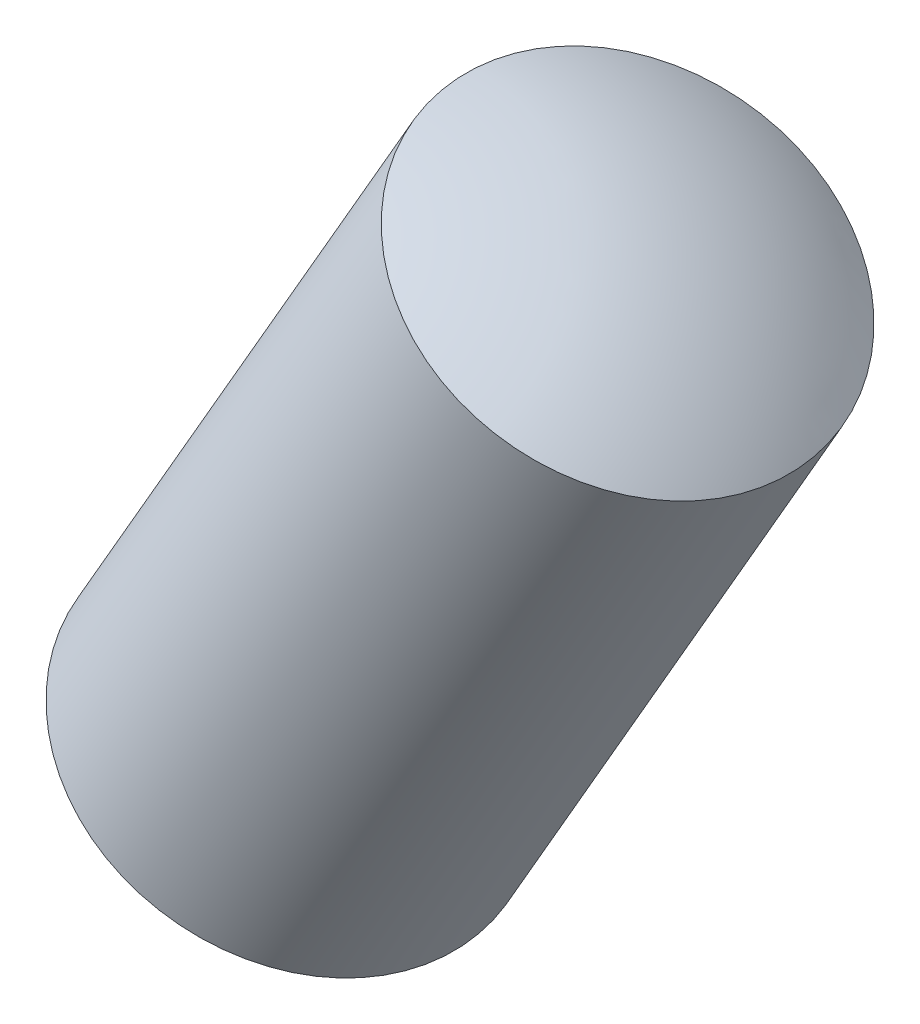
ISO-10303-21;
HEADER;
FILE_DESCRIPTION(('STEP AP214'),'2;1');
FILE_NAME('part.step','',(''),(''),'','','');
FILE_SCHEMA(('AUTOMOTIVE_DESIGN { 1 0 10303 214 1 1 1 1 }'));
ENDSEC;
DATA;
#1=APPLICATION_CONTEXT('core data for automotive mechanical design processes');
#2=APPLICATION_PROTOCOL_DEFINITION('international standard','automotive_design',2000,#1);
#3=PRODUCT_CONTEXT('',#1,'mechanical');
#4=PRODUCT('Part','Part','',(#3));
#5=PRODUCT_RELATED_PRODUCT_CATEGORY('part','',(#4));
#6=PRODUCT_DEFINITION_FORMATION('','',#4);
#7=PRODUCT_DEFINITION_CONTEXT('part definition',#1,'design');
#8=PRODUCT_DEFINITION('design','',#6,#7);
#9=PRODUCT_DEFINITION_SHAPE('','',#8);
#10=(LENGTH_UNIT() NAMED_UNIT(*) SI_UNIT(.MILLI.,.METRE.));
#11=(NAMED_UNIT(*) PLANE_ANGLE_UNIT() SI_UNIT($,.RADIAN.));
#12=(NAMED_UNIT(*) SI_UNIT($,.STERADIAN.) SOLID_ANGLE_UNIT());
#13=UNCERTAINTY_MEASURE_WITH_UNIT(LENGTH_MEASURE(1.E-05),#10,'distance_accuracy_value','');
#14=(GEOMETRIC_REPRESENTATION_CONTEXT(3) GLOBAL_UNCERTAINTY_ASSIGNED_CONTEXT((#13)) GLOBAL_UNIT_ASSIGNED_CONTEXT((#10,
#11,#12)) REPRESENTATION_CONTEXT('',''));
#15=CARTESIAN_POINT('',(0.,0.,0.));
#16=DIRECTION('',(0.,0.,1.));
#17=DIRECTION('',(1.,0.,0.));
#18=AXIS2_PLACEMENT_3D('',#15,#16,#17);
#19=CARTESIAN_POINT('',(13.8009618943233,23.9039671942901,0.9));
#20=DIRECTION('',(0.866025403784439,-0.5,0.));
#21=DIRECTION('',(0.5,0.866025403784439,0.));
#22=AXIS2_PLACEMENT_3D('',#19,#20,#21);
#23=SPHERICAL_SURFACE('',#22,3.);
#24=CARTESIAN_POINT('',(13.8009618943233,23.9039671942901,0.9));
#25=DIRECTION('',(-0.5,-0.866025403784439,0.));
#26=DIRECTION('',(0.,0.,-1.));
#27=AXIS2_PLACEMENT_3D('',#24,#25,#26);
#28=SPHERICAL_SURFACE('',#27,3.);
#29=CARTESIAN_POINT('',(15.1,26.1539671942901,0.9));
#30=DIRECTION('',(-0.5,-0.866025403784439,0.));
#31=DIRECTION('',(0.,0.,-1.));
#32=AXIS2_PLACEMENT_3D('',#29,#30,#31);
#33=CIRCLE('',#32,1.5);
#34=CARTESIAN_POINT('',(15.1,26.1539671942901,-0.6));
#35=VERTEX_POINT('',#34);
#36=EDGE_CURVE('E11',#35,#35,#33,.T.);
#37=ORIENTED_EDGE('',*,*,#36,.F.);
#38=EDGE_LOOP('',(#37));
#39=FACE_BOUND('',#38,.T.);
#40=ADVANCED_FACE('F17',(#39),#28,.T.);
#41=CARTESIAN_POINT('',(13.6990381056767,23.7274300138542,0.9));
#42=DIRECTION('',(0.866025403784439,-0.5,0.));
#43=DIRECTION('',(-0.5,-0.866025403784439,0.));
#44=AXIS2_PLACEMENT_3D('',#41,#42,#43);
#45=SPHERICAL_SURFACE('',#44,3.);
#46=CARTESIAN_POINT('',(13.6990381056767,23.7274300138542,0.9));
#47=DIRECTION('',(-0.5,-0.866025403784439,0.));
#48=DIRECTION('',(0.,0.,-1.));
#49=AXIS2_PLACEMENT_3D('',#46,#47,#48);
#50=SPHERICAL_SURFACE('',#49,3.);
#51=CARTESIAN_POINT('',(12.4,21.477430013854,0.9));
#52=DIRECTION('',(-0.5,-0.866025403784439,0.));
#53=DIRECTION('',(0.,0.,-1.));
#54=AXIS2_PLACEMENT_3D('',#51,#52,#53);
#55=CIRCLE('',#54,1.5);
#56=CARTESIAN_POINT('',(12.4,21.477430013854,-0.6));
#57=VERTEX_POINT('',#56);
#58=EDGE_CURVE('E26',#57,#57,#55,.T.);
#59=ORIENTED_EDGE('',*,*,#58,.T.);
#60=EDGE_LOOP('',(#59));
#61=FACE_BOUND('',#60,.T.);
#62=ADVANCED_FACE('F39',(#61),#50,.T.);
#63=CARTESIAN_POINT('',(13.075,22.6465643089631,0.9));
#64=DIRECTION('',(-0.5,-0.866025403784439,0.));
#65=DIRECTION('',(0.,0.,-1.));
#66=AXIS2_PLACEMENT_3D('',#63,#64,#65);
#67=CYLINDRICAL_SURFACE('',#66,1.5);
#68=ORIENTED_EDGE('',*,*,#36,.T.);
#69=EDGE_LOOP('',(#68));
#70=FACE_BOUND('',#69,.T.);
#71=ORIENTED_EDGE('',*,*,#58,.F.);
#72=EDGE_LOOP('',(#71));
#73=FACE_BOUND('',#72,.T.);
#74=ADVANCED_FACE('F51',(#70,#73),#67,.T.);
#75=CLOSED_SHELL('',(#40,#62,#74));
#76=MANIFOLD_SOLID_BREP('B1',#75);
#77=ADVANCED_BREP_SHAPE_REPRESENTATION('',(#18,#76),#14);
#78=SHAPE_DEFINITION_REPRESENTATION(#9,#77);
ENDSEC;
END-ISO-10303-21;
